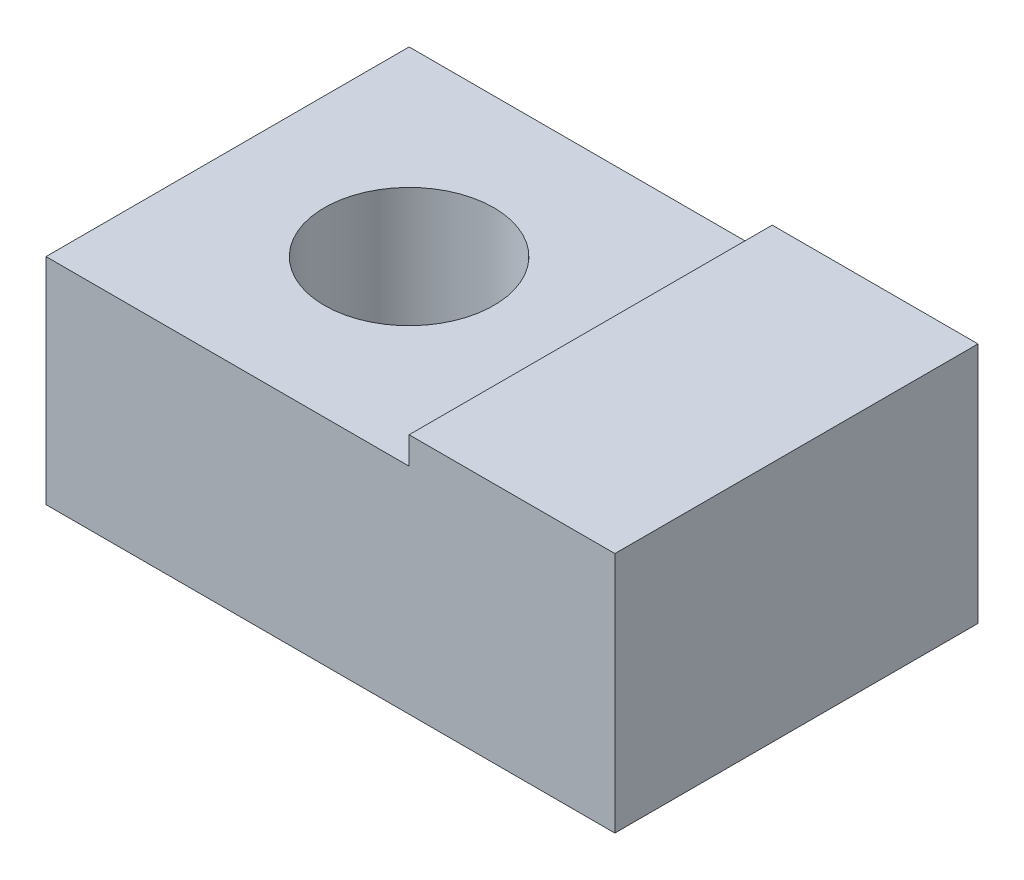
ISO-10303-21;
HEADER;
FILE_DESCRIPTION(('STEP AP214'),'2;1');
FILE_NAME('part.step','',(''),(''),'','','');
FILE_SCHEMA(('AUTOMOTIVE_DESIGN { 1 0 10303 214 1 1 1 1 }'));
ENDSEC;
DATA;
#1=APPLICATION_CONTEXT('core data for automotive mechanical design processes');
#2=APPLICATION_PROTOCOL_DEFINITION('international standard','automotive_design',2000,#1);
#3=PRODUCT_CONTEXT('',#1,'mechanical');
#4=PRODUCT('Part','Part','',(#3));
#5=PRODUCT_RELATED_PRODUCT_CATEGORY('part','',(#4));
#6=PRODUCT_DEFINITION_FORMATION('','',#4);
#7=PRODUCT_DEFINITION_CONTEXT('part definition',#1,'design');
#8=PRODUCT_DEFINITION('design','',#6,#7);
#9=PRODUCT_DEFINITION_SHAPE('','',#8);
#10=(LENGTH_UNIT() NAMED_UNIT(*) SI_UNIT(.MILLI.,.METRE.));
#11=(NAMED_UNIT(*) PLANE_ANGLE_UNIT() SI_UNIT($,.RADIAN.));
#12=(NAMED_UNIT(*) SI_UNIT($,.STERADIAN.) SOLID_ANGLE_UNIT());
#13=UNCERTAINTY_MEASURE_WITH_UNIT(LENGTH_MEASURE(1.E-05),#10,'distance_accuracy_value','');
#14=(GEOMETRIC_REPRESENTATION_CONTEXT(3) GLOBAL_UNCERTAINTY_ASSIGNED_CONTEXT((#13)) GLOBAL_UNIT_ASSIGNED_CONTEXT((#10,
#11,#12)) REPRESENTATION_CONTEXT('',''));
#15=CARTESIAN_POINT('',(0.,0.,0.));
#16=DIRECTION('',(0.,0.,1.));
#17=DIRECTION('',(1.,0.,0.));
#18=AXIS2_PLACEMENT_3D('',#15,#16,#17);
#19=CARTESIAN_POINT('',(13.,35.5,30.));
#20=DIRECTION('',(1.,0.,0.));
#21=DIRECTION('',(0.,0.,-1.));
#22=AXIS2_PLACEMENT_3D('',#19,#20,#21);
#23=PLANE('',#22);
#24=DIRECTION('',(0.,0.,-1.));
#25=VECTOR('',#24,1.);
#26=CARTESIAN_POINT('',(13.,35.5,30.));
#27=LINE('',#26,#25);
#28=CARTESIAN_POINT('',(13.,35.5,-30.));
#29=VERTEX_POINT('',#28);
#30=CARTESIAN_POINT('',(13.,35.5,30.));
#31=VERTEX_POINT('',#30);
#32=EDGE_CURVE('E84',#29,#31,#27,.F.);
#33=ORIENTED_EDGE('',*,*,#32,.T.);
#34=DIRECTION('',(0.,1.,0.));
#35=VECTOR('',#34,1.);
#36=CARTESIAN_POINT('',(13.,0.,30.));
#37=LINE('',#36,#35);
#38=CARTESIAN_POINT('',(13.,40.,30.));
#39=VERTEX_POINT('',#38);
#40=EDGE_CURVE('E91',#39,#31,#37,.F.);
#41=ORIENTED_EDGE('',*,*,#40,.F.);
#42=DIRECTION('',(0.,0.,1.));
#43=VECTOR('',#42,1.);
#44=CARTESIAN_POINT('',(13.,40.,0.));
#45=LINE('',#44,#43);
#46=CARTESIAN_POINT('',(13.,40.,-30.));
#47=VERTEX_POINT('',#46);
#48=EDGE_CURVE('E67',#47,#39,#45,.T.);
#49=ORIENTED_EDGE('',*,*,#48,.F.);
#50=DIRECTION('',(0.,1.,0.));
#51=VECTOR('',#50,1.);
#52=CARTESIAN_POINT('',(13.,0.,-30.));
#53=LINE('',#52,#51);
#54=EDGE_CURVE('E106',#29,#47,#53,.T.);
#55=ORIENTED_EDGE('',*,*,#54,.F.);
#56=EDGE_LOOP('',(#33,#41,#49,#55));
#57=FACE_BOUND('',#56,.T.);
#58=ADVANCED_FACE('F17',(#57),#23,.F.);
#59=CARTESIAN_POINT('',(0.,40.,0.));
#60=DIRECTION('',(0.,1.,0.));
#61=DIRECTION('',(0.,0.,1.));
#62=AXIS2_PLACEMENT_3D('',#59,#60,#61);
#63=PLANE('',#62);
#64=DIRECTION('',(-1.,0.,0.));
#65=VECTOR('',#64,1.);
#66=CARTESIAN_POINT('',(47.,40.,-30.));
#67=LINE('',#66,#65);
#68=CARTESIAN_POINT('',(47.,40.,-30.));
#69=VERTEX_POINT('',#68);
#70=EDGE_CURVE('E116',#47,#69,#67,.F.);
#71=ORIENTED_EDGE('',*,*,#70,.F.);
#72=ORIENTED_EDGE('',*,*,#48,.T.);
#73=DIRECTION('',(1.,0.,0.));
#74=VECTOR('',#73,1.);
#75=CARTESIAN_POINT('',(-47.,40.,30.));
#76=LINE('',#75,#74);
#77=CARTESIAN_POINT('',(47.,40.,30.));
#78=VERTEX_POINT('',#77);
#79=EDGE_CURVE('E98',#78,#39,#76,.F.);
#80=ORIENTED_EDGE('',*,*,#79,.F.);
#81=DIRECTION('',(0.,0.,-1.));
#82=VECTOR('',#81,1.);
#83=CARTESIAN_POINT('',(47.,40.,30.));
#84=LINE('',#83,#82);
#85=EDGE_CURVE('E93',#69,#78,#84,.F.);
#86=ORIENTED_EDGE('',*,*,#85,.F.);
#87=EDGE_LOOP('',(#71,#72,#80,#86));
#88=FACE_BOUND('',#87,.T.);
#89=ADVANCED_FACE('F127',(#88),#63,.T.);
#90=CARTESIAN_POINT('',(-47.,35.5,30.));
#91=DIRECTION('',(0.,-1.,0.));
#92=DIRECTION('',(0.,0.,-1.));
#93=AXIS2_PLACEMENT_3D('',#90,#91,#92);
#94=PLANE('',#93);
#95=CARTESIAN_POINT('',(-17.,35.5,0.));
#96=DIRECTION('',(0.,1.,0.));
#97=DIRECTION('',(0.,0.,1.));
#98=AXIS2_PLACEMENT_3D('',#95,#96,#97);
#99=CIRCLE('',#98,14.);
#100=CARTESIAN_POINT('',(-17.,35.5,14.));
#101=VERTEX_POINT('',#100);
#102=EDGE_CURVE('E20',#101,#101,#99,.F.);
#103=ORIENTED_EDGE('',*,*,#102,.T.);
#104=EDGE_LOOP('',(#103));
#105=FACE_BOUND('',#104,.T.);
#106=ORIENTED_EDGE('',*,*,#32,.F.);
#107=DIRECTION('',(-1.,0.,0.));
#108=VECTOR('',#107,1.);
#109=CARTESIAN_POINT('',(47.,35.5,-30.));
#110=LINE('',#109,#108);
#111=CARTESIAN_POINT('',(-47.,35.5,-30.));
#112=VERTEX_POINT('',#111);
#113=EDGE_CURVE('E78',#112,#29,#110,.F.);
#114=ORIENTED_EDGE('',*,*,#113,.F.);
#115=DIRECTION('',(0.,0.,1.));
#116=VECTOR('',#115,1.);
#117=CARTESIAN_POINT('',(-47.,35.5,-30.));
#118=LINE('',#117,#116);
#119=CARTESIAN_POINT('',(-47.,35.5,30.));
#120=VERTEX_POINT('',#119);
#121=EDGE_CURVE('E73',#120,#112,#118,.F.);
#122=ORIENTED_EDGE('',*,*,#121,.F.);
#123=DIRECTION('',(1.,0.,0.));
#124=VECTOR('',#123,1.);
#125=CARTESIAN_POINT('',(-47.,35.5,30.));
#126=LINE('',#125,#124);
#127=EDGE_CURVE('E76',#31,#120,#126,.F.);
#128=ORIENTED_EDGE('',*,*,#127,.F.);
#129=EDGE_LOOP('',(#106,#114,#122,#128));
#130=FACE_BOUND('',#129,.T.);
#131=ADVANCED_FACE('F75',(#105,#130),#94,.F.);
#132=CARTESIAN_POINT('',(-47.,0.,-30.));
#133=DIRECTION('',(-1.,0.,0.));
#134=DIRECTION('',(0.,0.,1.));
#135=AXIS2_PLACEMENT_3D('',#132,#133,#134);
#136=PLANE('',#135);
#137=DIRECTION('',(0.,1.,0.));
#138=VECTOR('',#137,1.);
#139=CARTESIAN_POINT('',(-47.,0.,30.));
#140=LINE('',#139,#138);
#141=CARTESIAN_POINT('',(-47.,0.,30.));
#142=VERTEX_POINT('',#141);
#143=EDGE_CURVE('E83',#120,#142,#140,.F.);
#144=ORIENTED_EDGE('',*,*,#143,.F.);
#145=ORIENTED_EDGE('',*,*,#121,.T.);
#146=DIRECTION('',(0.,1.,0.));
#147=VECTOR('',#146,1.);
#148=CARTESIAN_POINT('',(-47.,0.,-30.));
#149=LINE('',#148,#147);
#150=CARTESIAN_POINT('',(-47.,0.,-30.));
#151=VERTEX_POINT('',#150);
#152=EDGE_CURVE('E108',#151,#112,#149,.T.);
#153=ORIENTED_EDGE('',*,*,#152,.F.);
#154=DIRECTION('',(0.,0.,1.));
#155=VECTOR('',#154,1.);
#156=CARTESIAN_POINT('',(-47.,0.,0.));
#157=LINE('',#156,#155);
#158=EDGE_CURVE('E97',#151,#142,#157,.T.);
#159=ORIENTED_EDGE('',*,*,#158,.T.);
#160=EDGE_LOOP('',(#144,#145,#153,#159));
#161=FACE_BOUND('',#160,.T.);
#162=ADVANCED_FACE('F96',(#161),#136,.T.);
#163=CARTESIAN_POINT('',(-47.,0.,30.));
#164=DIRECTION('',(0.,0.,1.));
#165=DIRECTION('',(1.,0.,0.));
#166=AXIS2_PLACEMENT_3D('',#163,#164,#165);
#167=PLANE('',#166);
#168=ORIENTED_EDGE('',*,*,#40,.T.);
#169=ORIENTED_EDGE('',*,*,#127,.T.);
#170=ORIENTED_EDGE('',*,*,#143,.T.);
#171=DIRECTION('',(1.,0.,0.));
#172=VECTOR('',#171,1.);
#173=CARTESIAN_POINT('',(0.,0.,30.));
#174=LINE('',#173,#172);
#175=CARTESIAN_POINT('',(47.,0.,30.));
#176=VERTEX_POINT('',#175);
#177=EDGE_CURVE('E128',#142,#176,#174,.T.);
#178=ORIENTED_EDGE('',*,*,#177,.T.);
#179=DIRECTION('',(0.,1.,0.));
#180=VECTOR('',#179,1.);
#181=CARTESIAN_POINT('',(47.,0.,30.));
#182=LINE('',#181,#180);
#183=EDGE_CURVE('E119',#78,#176,#182,.F.);
#184=ORIENTED_EDGE('',*,*,#183,.F.);
#185=ORIENTED_EDGE('',*,*,#79,.T.);
#186=EDGE_LOOP('',(#168,#169,#170,#178,#184,#185));
#187=FACE_BOUND('',#186,.T.);
#188=ADVANCED_FACE('F87',(#187),#167,.T.);
#189=CARTESIAN_POINT('',(47.,0.,30.));
#190=DIRECTION('',(1.,0.,0.));
#191=DIRECTION('',(0.,0.,-1.));
#192=AXIS2_PLACEMENT_3D('',#189,#190,#191);
#193=PLANE('',#192);
#194=ORIENTED_EDGE('',*,*,#183,.T.);
#195=DIRECTION('',(0.,0.,1.));
#196=VECTOR('',#195,1.);
#197=CARTESIAN_POINT('',(47.,0.,0.));
#198=LINE('',#197,#196);
#199=CARTESIAN_POINT('',(47.,0.,-30.));
#200=VERTEX_POINT('',#199);
#201=EDGE_CURVE('E130',#176,#200,#198,.F.);
#202=ORIENTED_EDGE('',*,*,#201,.T.);
#203=DIRECTION('',(0.,1.,0.));
#204=VECTOR('',#203,1.);
#205=CARTESIAN_POINT('',(47.,0.,-30.));
#206=LINE('',#205,#204);
#207=EDGE_CURVE('E34',#69,#200,#206,.F.);
#208=ORIENTED_EDGE('',*,*,#207,.F.);
#209=ORIENTED_EDGE('',*,*,#85,.T.);
#210=EDGE_LOOP('',(#194,#202,#208,#209));
#211=FACE_BOUND('',#210,.T.);
#212=ADVANCED_FACE('F123',(#211),#193,.T.);
#213=CARTESIAN_POINT('',(47.,0.,-30.));
#214=DIRECTION('',(0.,0.,-1.));
#215=DIRECTION('',(-1.,0.,0.));
#216=AXIS2_PLACEMENT_3D('',#213,#214,#215);
#217=PLANE('',#216);
#218=ORIENTED_EDGE('',*,*,#152,.T.);
#219=ORIENTED_EDGE('',*,*,#113,.T.);
#220=ORIENTED_EDGE('',*,*,#54,.T.);
#221=ORIENTED_EDGE('',*,*,#70,.T.);
#222=ORIENTED_EDGE('',*,*,#207,.T.);
#223=DIRECTION('',(1.,0.,0.));
#224=VECTOR('',#223,1.);
#225=CARTESIAN_POINT('',(0.,0.,-30.));
#226=LINE('',#225,#224);
#227=EDGE_CURVE('E26',#200,#151,#226,.F.);
#228=ORIENTED_EDGE('',*,*,#227,.T.);
#229=EDGE_LOOP('',(#218,#219,#220,#221,#222,#228));
#230=FACE_BOUND('',#229,.T.);
#231=ADVANCED_FACE('F107',(#230),#217,.T.);
#232=CARTESIAN_POINT('',(-17.,-86.0063121584,0.));
#233=DIRECTION('',(0.,1.,0.));
#234=DIRECTION('',(0.,0.,1.));
#235=AXIS2_PLACEMENT_3D('',#232,#233,#234);
#236=CYLINDRICAL_SURFACE('',#235,14.);
#237=CARTESIAN_POINT('',(-17.,0.,0.));
#238=DIRECTION('',(0.,1.,0.));
#239=DIRECTION('',(0.,0.,1.));
#240=AXIS2_PLACEMENT_3D('',#237,#238,#239);
#241=CIRCLE('',#240,14.);
#242=CARTESIAN_POINT('',(-17.,0.,14.));
#243=VERTEX_POINT('',#242);
#244=EDGE_CURVE('E11',#243,#243,#241,.F.);
#245=ORIENTED_EDGE('',*,*,#244,.T.);
#246=EDGE_LOOP('',(#245));
#247=FACE_BOUND('',#246,.T.);
#248=ORIENTED_EDGE('',*,*,#102,.F.);
#249=EDGE_LOOP('',(#248));
#250=FACE_BOUND('',#249,.T.);
#251=ADVANCED_FACE('F135',(#247,#250),#236,.F.);
#252=CARTESIAN_POINT('',(0.,0.,0.));
#253=DIRECTION('',(0.,1.,0.));
#254=DIRECTION('',(0.,0.,1.));
#255=AXIS2_PLACEMENT_3D('',#252,#253,#254);
#256=PLANE('',#255);
#257=ORIENTED_EDGE('',*,*,#244,.F.);
#258=EDGE_LOOP('',(#257));
#259=FACE_BOUND('',#258,.T.);
#260=ORIENTED_EDGE('',*,*,#201,.F.);
#261=ORIENTED_EDGE('',*,*,#177,.F.);
#262=ORIENTED_EDGE('',*,*,#158,.F.);
#263=ORIENTED_EDGE('',*,*,#227,.F.);
#264=EDGE_LOOP('',(#260,#261,#262,#263));
#265=FACE_BOUND('',#264,.T.);
#266=ADVANCED_FACE('F133',(#259,#265),#256,.F.);
#267=CLOSED_SHELL('',(#58,#89,#131,#162,#188,#212,#231,#251,#266));
#268=MANIFOLD_SOLID_BREP('B1',#267);
#269=ADVANCED_BREP_SHAPE_REPRESENTATION('',(#18,#268),#14);
#270=SHAPE_DEFINITION_REPRESENTATION(#9,#269);
ENDSEC;
END-ISO-10303-21;
